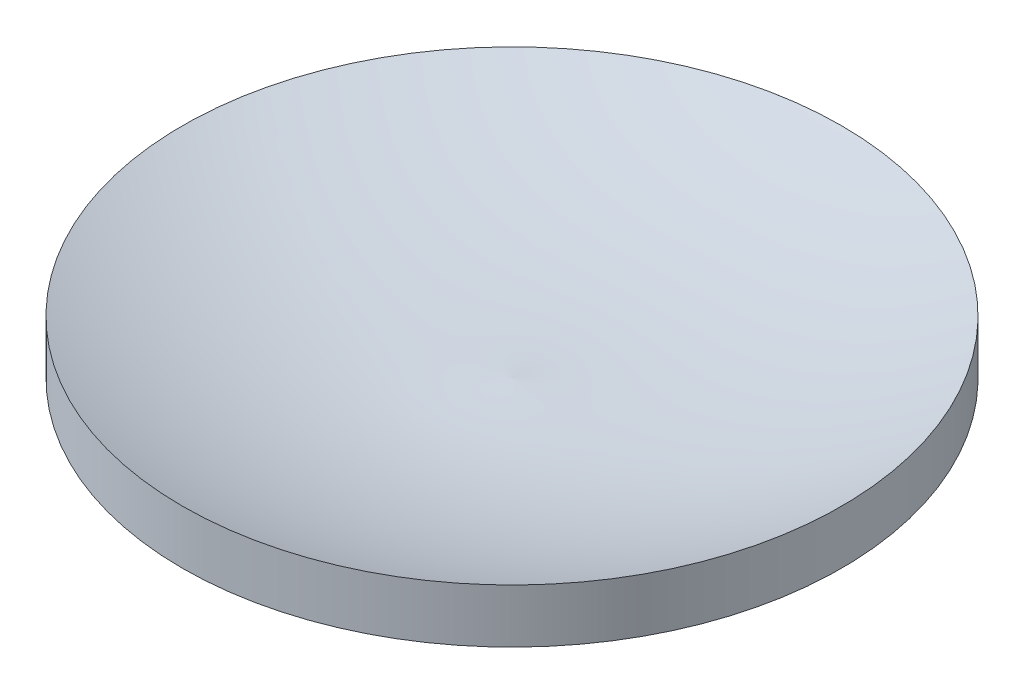
ISO-10303-21;
HEADER;
FILE_DESCRIPTION(('STEP AP214'),'2;1');
FILE_NAME('part.step','',(''),(''),'','','');
FILE_SCHEMA(('AUTOMOTIVE_DESIGN { 1 0 10303 214 1 1 1 1 }'));
ENDSEC;
DATA;
#1=APPLICATION_CONTEXT('core data for automotive mechanical design processes');
#2=APPLICATION_PROTOCOL_DEFINITION('international standard','automotive_design',2000,#1);
#3=PRODUCT_CONTEXT('',#1,'mechanical');
#4=PRODUCT('Part','Part','',(#3));
#5=PRODUCT_RELATED_PRODUCT_CATEGORY('part','',(#4));
#6=PRODUCT_DEFINITION_FORMATION('','',#4);
#7=PRODUCT_DEFINITION_CONTEXT('part definition',#1,'design');
#8=PRODUCT_DEFINITION('design','',#6,#7);
#9=PRODUCT_DEFINITION_SHAPE('','',#8);
#10=(LENGTH_UNIT() NAMED_UNIT(*) SI_UNIT(.MILLI.,.METRE.));
#11=(NAMED_UNIT(*) PLANE_ANGLE_UNIT() SI_UNIT($,.RADIAN.));
#12=(NAMED_UNIT(*) SI_UNIT($,.STERADIAN.) SOLID_ANGLE_UNIT());
#13=UNCERTAINTY_MEASURE_WITH_UNIT(LENGTH_MEASURE(1.E-05),#10,'distance_accuracy_value','');
#14=(GEOMETRIC_REPRESENTATION_CONTEXT(3) GLOBAL_UNCERTAINTY_ASSIGNED_CONTEXT((#13)) GLOBAL_UNIT_ASSIGNED_CONTEXT((#10,
#11,#12)) REPRESENTATION_CONTEXT('',''));
#15=CARTESIAN_POINT('',(0.,0.,0.));
#16=DIRECTION('',(0.,0.,1.));
#17=DIRECTION('',(1.,0.,0.));
#18=AXIS2_PLACEMENT_3D('',#15,#16,#17);
#19=CARTESIAN_POINT('',(0.,154.0625,0.));
#20=DIRECTION('',(0.,-1.,0.));
#21=DIRECTION('',(0.,0.,1.));
#22=AXIS2_PLACEMENT_3D('',#19,#20,#21);
#23=SPHERICAL_SURFACE('',#22,154.0625);
#24=CARTESIAN_POINT('',(0.,8.,0.));
#25=DIRECTION('',(0.,-1.,0.));
#26=DIRECTION('',(0.,0.,-1.));
#27=AXIS2_PLACEMENT_3D('',#24,#25,#26);
#28=CIRCLE('',#27,49.);
#29=CARTESIAN_POINT('',(0.,8.,-49.));
#30=VERTEX_POINT('',#29);
#31=EDGE_CURVE('E11',#30,#30,#28,.T.);
#32=ORIENTED_EDGE('',*,*,#31,.T.);
#33=EDGE_LOOP('',(#32));
#34=FACE_BOUND('',#33,.T.);
#35=ADVANCED_FACE('F34',(#34),#23,.T.);
#36=CARTESIAN_POINT('',(0.,0.,0.));
#37=DIRECTION('',(0.,-1.,0.));
#38=DIRECTION('',(0.,0.,-1.));
#39=AXIS2_PLACEMENT_3D('',#36,#37,#38);
#40=CYLINDRICAL_SURFACE('',#39,49.);
#41=CARTESIAN_POINT('',(0.,16.,0.));
#42=DIRECTION('',(0.,-1.,0.));
#43=DIRECTION('',(0.,0.,-1.));
#44=AXIS2_PLACEMENT_3D('',#41,#42,#43);
#45=CIRCLE('',#44,49.);
#46=CARTESIAN_POINT('',(0.,16.,-49.));
#47=VERTEX_POINT('',#46);
#48=EDGE_CURVE('E40',#47,#47,#45,.T.);
#49=ORIENTED_EDGE('',*,*,#48,.T.);
#50=EDGE_LOOP('',(#49));
#51=FACE_BOUND('',#50,.T.);
#52=ORIENTED_EDGE('',*,*,#31,.F.);
#53=EDGE_LOOP('',(#52));
#54=FACE_BOUND('',#53,.T.);
#55=ADVANCED_FACE('F46',(#51,#54),#40,.T.);
#56=CARTESIAN_POINT('',(0.,113.959349996575,-7.85357551076321));
#57=DIRECTION('',(-1.,0.,0.));
#58=DIRECTION('',(0.,0.,-1.));
#59=AXIS2_PLACEMENT_3D('',#56,#57,#58);
#60=CIRCLE('',#59,106.25);
#61=TRIMMED_CURVE('',#60,(PARAMETER_VALUE(-1.64477980524082)),
(PARAMETER_VALUE(1.64477980524082)),.T.,.PARAMETER.);
#62=CARTESIAN_POINT('',(0.,113.959349996575,0.));
#63=DIRECTION('',(0.,-1.,0.));
#64=AXIS1_PLACEMENT('',#62,#63);
#65=SURFACE_OF_REVOLUTION('',#61,#64);
#66=CARTESIAN_POINT('',(0.,8.,0.));
#67=VERTEX_POINT('',#66);
#68=VERTEX_LOOP('',#67);
#69=FACE_BOUND('',#68,.T.);
#70=ORIENTED_EDGE('',*,*,#48,.F.);
#71=EDGE_LOOP('',(#70));
#72=FACE_BOUND('',#71,.T.);
#73=ADVANCED_FACE('F43',(#69,#72),#65,.F.);
#74=CLOSED_SHELL('',(#35,#55,#73));
#75=MANIFOLD_SOLID_BREP('B2',#74);
#76=ADVANCED_BREP_SHAPE_REPRESENTATION('',(#18,#75),#14);
#77=SHAPE_DEFINITION_REPRESENTATION(#9,#76);
ENDSEC;
END-ISO-10303-21;
